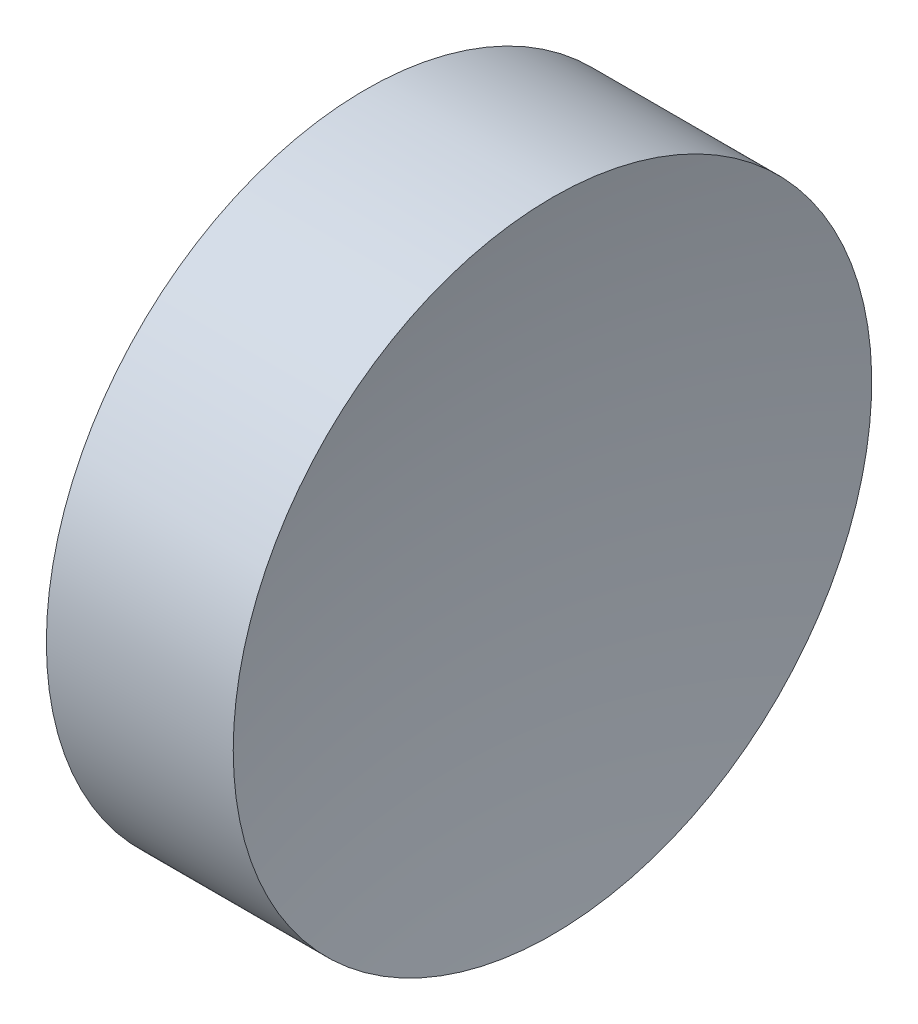
ISO-10303-21;
HEADER;
FILE_DESCRIPTION(('STEP AP214'),'2;1');
FILE_NAME('part.step','',(''),(''),'','','');
FILE_SCHEMA(('AUTOMOTIVE_DESIGN { 1 0 10303 214 1 1 1 1 }'));
ENDSEC;
DATA;
#1=APPLICATION_CONTEXT('core data for automotive mechanical design processes');
#2=APPLICATION_PROTOCOL_DEFINITION('international standard','automotive_design',2000,#1);
#3=PRODUCT_CONTEXT('',#1,'mechanical');
#4=PRODUCT('Part','Part','',(#3));
#5=PRODUCT_RELATED_PRODUCT_CATEGORY('part','',(#4));
#6=PRODUCT_DEFINITION_FORMATION('','',#4);
#7=PRODUCT_DEFINITION_CONTEXT('part definition',#1,'design');
#8=PRODUCT_DEFINITION('design','',#6,#7);
#9=PRODUCT_DEFINITION_SHAPE('','',#8);
#10=(LENGTH_UNIT() NAMED_UNIT(*) SI_UNIT(.MILLI.,.METRE.));
#11=(NAMED_UNIT(*) PLANE_ANGLE_UNIT() SI_UNIT($,.RADIAN.));
#12=(NAMED_UNIT(*) SI_UNIT($,.STERADIAN.) SOLID_ANGLE_UNIT());
#13=UNCERTAINTY_MEASURE_WITH_UNIT(LENGTH_MEASURE(1.E-05),#10,'distance_accuracy_value','');
#14=(GEOMETRIC_REPRESENTATION_CONTEXT(3) GLOBAL_UNCERTAINTY_ASSIGNED_CONTEXT((#13)) GLOBAL_UNIT_ASSIGNED_CONTEXT((#10,
#11,#12)) REPRESENTATION_CONTEXT('',''));
#15=CARTESIAN_POINT('',(0.,0.,0.));
#16=DIRECTION('',(0.,0.,1.));
#17=DIRECTION('',(1.,0.,0.));
#18=AXIS2_PLACEMENT_3D('',#15,#16,#17);
#19=CARTESIAN_POINT('',(181.092655549688,69.3780211233724,0.));
#20=DIRECTION('',(-1.,0.,0.));
#21=DIRECTION('',(0.,1.,0.));
#22=AXIS2_PLACEMENT_3D('',#19,#20,#21);
#23=SPHERICAL_SURFACE('',#22,60.);
#24=CARTESIAN_POINT('',(122.40918257816,69.3780211233724,0.));
#25=DIRECTION('',(-1.,0.,0.));
#26=DIRECTION('',(0.,0.,1.));
#27=AXIS2_PLACEMENT_3D('',#24,#25,#26);
#28=CIRCLE('',#27,12.5);
#29=CARTESIAN_POINT('',(122.40918257816,69.3780211233724,12.5));
#30=VERTEX_POINT('',#29);
#31=EDGE_CURVE('E10',#30,#30,#28,.T.);
#32=ORIENTED_EDGE('',*,*,#31,.F.);
#33=EDGE_LOOP('',(#32));
#34=FACE_BOUND('',#33,.T.);
#35=ADVANCED_FACE('F35',(#34),#23,.F.);
#36=CARTESIAN_POINT('',(108.985143002165,69.3780211233724,0.));
#37=DIRECTION('',(-1.,0.,0.));
#38=DIRECTION('',(0.,0.,1.));
#39=AXIS2_PLACEMENT_3D('',#36,#37,#38);
#40=CYLINDRICAL_SURFACE('',#39,12.5);
#41=CARTESIAN_POINT('',(115.09265553492,69.3780211233724,0.));
#42=DIRECTION('',(-1.,0.,0.));
#43=DIRECTION('',(0.,0.,1.));
#44=AXIS2_PLACEMENT_3D('',#41,#42,#43);
#45=CIRCLE('',#44,12.5);
#46=CARTESIAN_POINT('',(115.09265553492,69.3780211233724,12.5));
#47=VERTEX_POINT('',#46);
#48=EDGE_CURVE('E41',#47,#47,#45,.T.);
#49=ORIENTED_EDGE('',*,*,#48,.F.);
#50=EDGE_LOOP('',(#49));
#51=FACE_BOUND('',#50,.T.);
#52=ORIENTED_EDGE('',*,*,#31,.T.);
#53=EDGE_LOOP('',(#52));
#54=FACE_BOUND('',#53,.T.);
#55=ADVANCED_FACE('F49',(#51,#54),#40,.T.);
#56=CARTESIAN_POINT('',(115.09265553492,69.3780211233724,0.));
#57=DIRECTION('',(1.,0.,0.));
#58=DIRECTION('',(0.,0.,-1.));
#59=AXIS2_PLACEMENT_3D('',#56,#57,#58);
#60=PLANE('',#59);
#61=ORIENTED_EDGE('',*,*,#48,.T.);
#62=EDGE_LOOP('',(#61));
#63=FACE_BOUND('',#62,.T.);
#64=ADVANCED_FACE('F47',(#63),#60,.F.);
#65=CLOSED_SHELL('',(#35,#55,#64));
#66=MANIFOLD_SOLID_BREP('B2',#65);
#67=ADVANCED_BREP_SHAPE_REPRESENTATION('',(#18,#66),#14);
#68=SHAPE_DEFINITION_REPRESENTATION(#9,#67);
ENDSEC;
END-ISO-10303-21;
